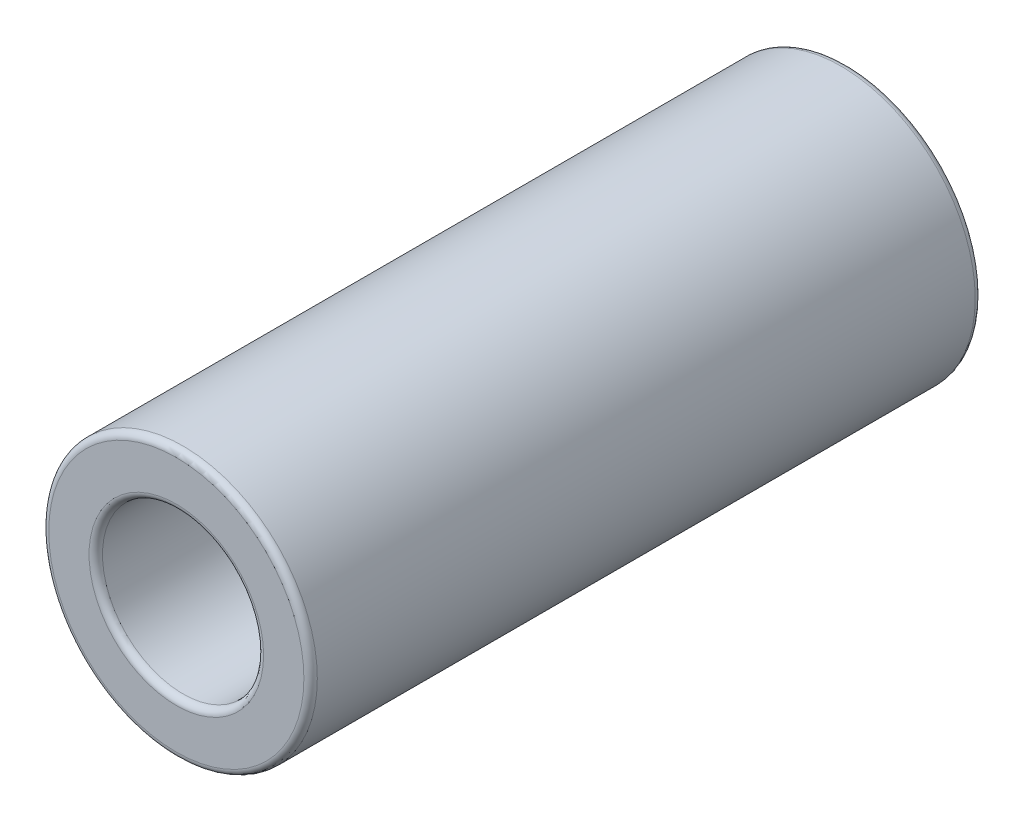
ISO-10303-21;
HEADER;
FILE_DESCRIPTION(('STEP AP214'),'2;1');
FILE_NAME('part.step','',(''),(''),'','','');
FILE_SCHEMA(('AUTOMOTIVE_DESIGN { 1 0 10303 214 1 1 1 1 }'));
ENDSEC;
DATA;
#1=APPLICATION_CONTEXT('core data for automotive mechanical design processes');
#2=APPLICATION_PROTOCOL_DEFINITION('international standard','automotive_design',2000,#1);
#3=PRODUCT_CONTEXT('',#1,'mechanical');
#4=PRODUCT('Part','Part','',(#3));
#5=PRODUCT_RELATED_PRODUCT_CATEGORY('part','',(#4));
#6=PRODUCT_DEFINITION_FORMATION('','',#4);
#7=PRODUCT_DEFINITION_CONTEXT('part definition',#1,'design');
#8=PRODUCT_DEFINITION('design','',#6,#7);
#9=PRODUCT_DEFINITION_SHAPE('','',#8);
#10=(LENGTH_UNIT() NAMED_UNIT(*) SI_UNIT(.MILLI.,.METRE.));
#11=(NAMED_UNIT(*) PLANE_ANGLE_UNIT() SI_UNIT($,.RADIAN.));
#12=(NAMED_UNIT(*) SI_UNIT($,.STERADIAN.) SOLID_ANGLE_UNIT());
#13=UNCERTAINTY_MEASURE_WITH_UNIT(LENGTH_MEASURE(1.E-05),#10,'distance_accuracy_value','');
#14=(GEOMETRIC_REPRESENTATION_CONTEXT(3) GLOBAL_UNCERTAINTY_ASSIGNED_CONTEXT((#13)) GLOBAL_UNIT_ASSIGNED_CONTEXT((#10,
#11,#12)) REPRESENTATION_CONTEXT('',''));
#15=CARTESIAN_POINT('',(0.,0.,0.));
#16=DIRECTION('',(0.,0.,1.));
#17=DIRECTION('',(1.,0.,0.));
#18=AXIS2_PLACEMENT_3D('',#15,#16,#17);
#19=CARTESIAN_POINT('',(0.,0.,-24.9999999999999));
#20=DIRECTION('',(0.,0.,1.));
#21=DIRECTION('',(1.,0.,0.));
#22=AXIS2_PLACEMENT_3D('',#19,#20,#21);
#23=CYLINDRICAL_SURFACE('',#22,5.);
#24=CARTESIAN_POINT('',(0.,0.,-24.7499999999998));
#25=DIRECTION('',(0.,0.,1.));
#26=DIRECTION('',(1.,0.,0.));
#27=AXIS2_PLACEMENT_3D('',#24,#25,#26);
#28=CIRCLE('',#27,5.);
#29=CARTESIAN_POINT('',(5.,0.,-24.7499999999998));
#30=VERTEX_POINT('',#29);
#31=EDGE_CURVE('E73',#30,#30,#28,.T.);
#32=ORIENTED_EDGE('',*,*,#31,.T.);
#33=EDGE_LOOP('',(#32));
#34=FACE_BOUND('',#33,.T.);
#35=CARTESIAN_POINT('',(0.,0.,-0.249999999999806));
#36=DIRECTION('',(0.,0.,1.));
#37=DIRECTION('',(1.,0.,0.));
#38=AXIS2_PLACEMENT_3D('',#35,#36,#37);
#39=CIRCLE('',#38,5.);
#40=CARTESIAN_POINT('',(5.,0.,-0.249999999999806));
#41=VERTEX_POINT('',#40);
#42=EDGE_CURVE('E79',#41,#41,#39,.F.);
#43=ORIENTED_EDGE('',*,*,#42,.T.);
#44=EDGE_LOOP('',(#43));
#45=FACE_BOUND('',#44,.T.);
#46=ADVANCED_FACE('F59',(#34,#45),#23,.T.);
#47=CARTESIAN_POINT('',(0.,0.,-24.9999999999999));
#48=DIRECTION('',(0.,0.,1.));
#49=DIRECTION('',(1.,0.,0.));
#50=AXIS2_PLACEMENT_3D('',#47,#48,#49);
#51=PLANE('',#50);
#52=CARTESIAN_POINT('',(0.,0.,-24.9999999999999));
#53=DIRECTION('',(0.,0.,1.));
#54=DIRECTION('',(1.,0.,0.));
#55=AXIS2_PLACEMENT_3D('',#52,#53,#54);
#56=CIRCLE('',#55,3.25);
#57=CARTESIAN_POINT('',(3.25,0.,-24.9999999999999));
#58=VERTEX_POINT('',#57);
#59=EDGE_CURVE('E93',#58,#58,#56,.T.);
#60=ORIENTED_EDGE('',*,*,#59,.T.);
#61=EDGE_LOOP('',(#60));
#62=FACE_BOUND('',#61,.T.);
#63=CARTESIAN_POINT('',(0.,0.,-24.9999999999999));
#64=DIRECTION('',(0.,0.,1.));
#65=DIRECTION('',(1.,0.,0.));
#66=AXIS2_PLACEMENT_3D('',#63,#64,#65);
#67=CIRCLE('',#66,4.75);
#68=CARTESIAN_POINT('',(4.75,0.,-24.9999999999999));
#69=VERTEX_POINT('',#68);
#70=EDGE_CURVE('E97',#69,#69,#67,.F.);
#71=ORIENTED_EDGE('',*,*,#70,.T.);
#72=EDGE_LOOP('',(#71));
#73=FACE_BOUND('',#72,.T.);
#74=ADVANCED_FACE('F103',(#62,#73),#51,.F.);
#75=CARTESIAN_POINT('',(0.,0.,0.));
#76=DIRECTION('',(0.,0.,1.));
#77=DIRECTION('',(1.,0.,0.));
#78=AXIS2_PLACEMENT_3D('',#75,#76,#77);
#79=PLANE('',#78);
#80=CARTESIAN_POINT('',(0.,0.,0.));
#81=DIRECTION('',(0.,0.,1.));
#82=DIRECTION('',(1.,0.,0.));
#83=AXIS2_PLACEMENT_3D('',#80,#81,#82);
#84=CIRCLE('',#83,3.25);
#85=CARTESIAN_POINT('',(3.25,0.,0.));
#86=VERTEX_POINT('',#85);
#87=EDGE_CURVE('E12',#86,#86,#84,.F.);
#88=ORIENTED_EDGE('',*,*,#87,.T.);
#89=EDGE_LOOP('',(#88));
#90=FACE_BOUND('',#89,.T.);
#91=CARTESIAN_POINT('',(0.,0.,0.));
#92=DIRECTION('',(0.,0.,1.));
#93=DIRECTION('',(1.,0.,0.));
#94=AXIS2_PLACEMENT_3D('',#91,#92,#93);
#95=CIRCLE('',#94,4.75);
#96=CARTESIAN_POINT('',(4.75,0.,0.));
#97=VERTEX_POINT('',#96);
#98=EDGE_CURVE('E67',#97,#97,#95,.T.);
#99=ORIENTED_EDGE('',*,*,#98,.T.);
#100=EDGE_LOOP('',(#99));
#101=FACE_BOUND('',#100,.T.);
#102=ADVANCED_FACE('F134',(#90,#101),#79,.T.);
#103=CARTESIAN_POINT('',(0.,0.,-24.9999999999999));
#104=DIRECTION('',(0.,0.,1.));
#105=DIRECTION('',(1.,0.,0.));
#106=AXIS2_PLACEMENT_3D('',#103,#104,#105);
#107=CYLINDRICAL_SURFACE('',#106,3.);
#108=CARTESIAN_POINT('',(0.,0.,-24.7499999999998));
#109=DIRECTION('',(0.,0.,1.));
#110=DIRECTION('',(1.,0.,0.));
#111=AXIS2_PLACEMENT_3D('',#108,#109,#110);
#112=CIRCLE('',#111,3.);
#113=CARTESIAN_POINT('',(3.,0.,-24.7499999999998));
#114=VERTEX_POINT('',#113);
#115=EDGE_CURVE('E85',#114,#114,#112,.F.);
#116=ORIENTED_EDGE('',*,*,#115,.T.);
#117=EDGE_LOOP('',(#116));
#118=FACE_BOUND('',#117,.T.);
#119=CARTESIAN_POINT('',(0.,0.,-0.249999999999806));
#120=DIRECTION('',(0.,0.,1.));
#121=DIRECTION('',(1.,0.,0.));
#122=AXIS2_PLACEMENT_3D('',#119,#120,#121);
#123=CIRCLE('',#122,3.);
#124=CARTESIAN_POINT('',(3.,0.,-0.249999999999806));
#125=VERTEX_POINT('',#124);
#126=EDGE_CURVE('E89',#125,#125,#123,.T.);
#127=ORIENTED_EDGE('',*,*,#126,.T.);
#128=EDGE_LOOP('',(#127));
#129=FACE_BOUND('',#128,.T.);
#130=ADVANCED_FACE('F131',(#118,#129),#107,.F.);
#131=CARTESIAN_POINT('',(0.,0.,-24.7499999999998));
#132=DIRECTION('',(0.,0.,1.));
#133=DIRECTION('',(1.,0.,0.));
#134=AXIS2_PLACEMENT_3D('',#131,#132,#133);
#135=TOROIDAL_SURFACE('',#134,3.25,0.25);
#136=ORIENTED_EDGE('',*,*,#115,.F.);
#137=EDGE_LOOP('',(#136));
#138=FACE_BOUND('',#137,.T.);
#139=ORIENTED_EDGE('',*,*,#59,.F.);
#140=EDGE_LOOP('',(#139));
#141=FACE_BOUND('',#140,.T.);
#142=ADVANCED_FACE('F109',(#138,#141),#135,.T.);
#143=CARTESIAN_POINT('',(0.,0.,-24.7499999999998));
#144=DIRECTION('',(0.,0.,1.));
#145=DIRECTION('',(1.,0.,0.));
#146=AXIS2_PLACEMENT_3D('',#143,#144,#145);
#147=TOROIDAL_SURFACE('',#146,4.75,0.25);
#148=ORIENTED_EDGE('',*,*,#70,.F.);
#149=EDGE_LOOP('',(#148));
#150=FACE_BOUND('',#149,.T.);
#151=ORIENTED_EDGE('',*,*,#31,.F.);
#152=EDGE_LOOP('',(#151));
#153=FACE_BOUND('',#152,.T.);
#154=ADVANCED_FACE('F105',(#150,#153),#147,.T.);
#155=CARTESIAN_POINT('',(0.,0.,-0.249999999999806));
#156=DIRECTION('',(0.,0.,1.));
#157=DIRECTION('',(1.,0.,0.));
#158=AXIS2_PLACEMENT_3D('',#155,#156,#157);
#159=TOROIDAL_SURFACE('',#158,3.25,0.25);
#160=ORIENTED_EDGE('',*,*,#87,.F.);
#161=EDGE_LOOP('',(#160));
#162=FACE_BOUND('',#161,.T.);
#163=ORIENTED_EDGE('',*,*,#126,.F.);
#164=EDGE_LOOP('',(#163));
#165=FACE_BOUND('',#164,.T.);
#166=ADVANCED_FACE('F108',(#162,#165),#159,.T.);
#167=CARTESIAN_POINT('',(0.,0.,-0.249999999999806));
#168=DIRECTION('',(0.,0.,1.));
#169=DIRECTION('',(1.,0.,0.));
#170=AXIS2_PLACEMENT_3D('',#167,#168,#169);
#171=TOROIDAL_SURFACE('',#170,4.75,0.25);
#172=ORIENTED_EDGE('',*,*,#42,.F.);
#173=EDGE_LOOP('',(#172));
#174=FACE_BOUND('',#173,.T.);
#175=ORIENTED_EDGE('',*,*,#98,.F.);
#176=EDGE_LOOP('',(#175));
#177=FACE_BOUND('',#176,.T.);
#178=ADVANCED_FACE('F61',(#174,#177),#171,.T.);
#179=CLOSED_SHELL('',(#46,#74,#102,#130,#142,#154,#166,#178));
#180=MANIFOLD_SOLID_BREP('B2',#179);
#181=ADVANCED_BREP_SHAPE_REPRESENTATION('',(#18,#180),#14);
#182=SHAPE_DEFINITION_REPRESENTATION(#9,#181);
ENDSEC;
END-ISO-10303-21;
